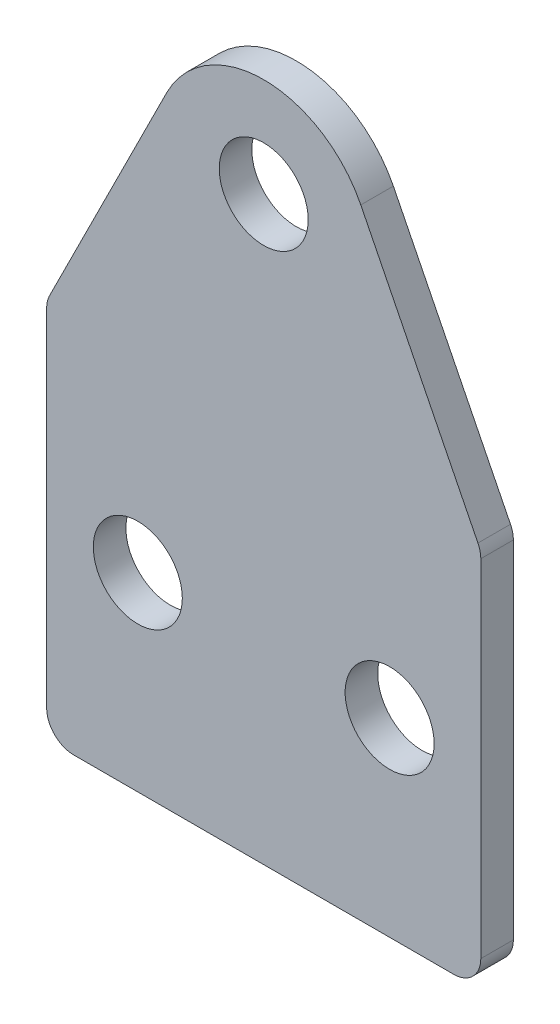
ISO-10303-21;
HEADER;
FILE_DESCRIPTION(('STEP AP214'),'2;1');
FILE_NAME('part.step','',(''),(''),'','','');
FILE_SCHEMA(('AUTOMOTIVE_DESIGN { 1 0 10303 214 1 1 1 1 }'));
ENDSEC;
DATA;
#1=APPLICATION_CONTEXT('core data for automotive mechanical design processes');
#2=APPLICATION_PROTOCOL_DEFINITION('international standard','automotive_design',2000,#1);
#3=PRODUCT_CONTEXT('',#1,'mechanical');
#4=PRODUCT('Part','Part','',(#3));
#5=PRODUCT_RELATED_PRODUCT_CATEGORY('part','',(#4));
#6=PRODUCT_DEFINITION_FORMATION('','',#4);
#7=PRODUCT_DEFINITION_CONTEXT('part definition',#1,'design');
#8=PRODUCT_DEFINITION('design','',#6,#7);
#9=PRODUCT_DEFINITION_SHAPE('','',#8);
#10=(LENGTH_UNIT() NAMED_UNIT(*) SI_UNIT(.MILLI.,.METRE.));
#11=(NAMED_UNIT(*) PLANE_ANGLE_UNIT() SI_UNIT($,.RADIAN.));
#12=(NAMED_UNIT(*) SI_UNIT($,.STERADIAN.) SOLID_ANGLE_UNIT());
#13=UNCERTAINTY_MEASURE_WITH_UNIT(LENGTH_MEASURE(1.E-05),#10,'distance_accuracy_value','');
#14=(GEOMETRIC_REPRESENTATION_CONTEXT(3) GLOBAL_UNCERTAINTY_ASSIGNED_CONTEXT((#13)) GLOBAL_UNIT_ASSIGNED_CONTEXT((#10,
#11,#12)) REPRESENTATION_CONTEXT('',''));
#15=CARTESIAN_POINT('',(0.,0.,0.));
#16=DIRECTION('',(0.,0.,1.));
#17=DIRECTION('',(1.,0.,0.));
#18=AXIS2_PLACEMENT_3D('',#15,#16,#17);
#19=CARTESIAN_POINT('',(0.,0.,3.));
#20=DIRECTION('',(0.,0.,1.));
#21=DIRECTION('',(1.,0.,0.));
#22=AXIS2_PLACEMENT_3D('',#19,#20,#21);
#23=PLANE('',#22);
#24=CARTESIAN_POINT('',(11.6,0.,3.));
#25=DIRECTION('',(0.,0.,1.));
#26=DIRECTION('',(1.,0.,0.));
#27=AXIS2_PLACEMENT_3D('',#24,#25,#26);
#28=CIRCLE('',#27,4.1);
#29=CARTESIAN_POINT('',(15.7,0.,3.));
#30=VERTEX_POINT('',#29);
#31=EDGE_CURVE('E188',#30,#30,#28,.T.);
#32=ORIENTED_EDGE('',*,*,#31,.F.);
#33=EDGE_LOOP('',(#32));
#34=FACE_BOUND('',#33,.T.);
#35=DIRECTION('',(-0.447213595499958,0.894427190999916,0.));
#36=VECTOR('',#35,1.);
#37=CARTESIAN_POINT('',(0.,57.5,3.));
#38=LINE('',#37,#36);
#39=CARTESIAN_POINT('',(19.7360679774998,18.0278640450004,3.));
#40=VERTEX_POINT('',#39);
#41=CARTESIAN_POINT('',(8.94427190999916,39.6114561800017,3.));
#42=VERTEX_POINT('',#41);
#43=EDGE_CURVE('E129',#40,#42,#38,.T.);
#44=ORIENTED_EDGE('',*,*,#43,.T.);
#45=CARTESIAN_POINT('',(0.,35.1393202250021,3.));
#46=DIRECTION('',(0.,0.,1.));
#47=DIRECTION('',(1.,0.,0.));
#48=AXIS2_PLACEMENT_3D('',#45,#46,#47);
#49=CIRCLE('',#48,10.);
#50=CARTESIAN_POINT('',(-8.94427190999916,39.6114561800017,3.));
#51=VERTEX_POINT('',#50);
#52=EDGE_CURVE('E9',#42,#51,#49,.T.);
#53=ORIENTED_EDGE('',*,*,#52,.T.);
#54=DIRECTION('',(-0.447213595499958,-0.894427190999916,0.));
#55=VECTOR('',#54,1.);
#56=CARTESIAN_POINT('',(-20.,17.5,3.));
#57=LINE('',#56,#55);
#58=CARTESIAN_POINT('',(-19.7360679774998,18.0278640450004,3.));
#59=VERTEX_POINT('',#58);
#60=EDGE_CURVE('E165',#51,#59,#57,.T.);
#61=ORIENTED_EDGE('',*,*,#60,.T.);
#62=CARTESIAN_POINT('',(-17.5,16.9098300562505,3.));
#63=DIRECTION('',(0.,0.,1.));
#64=DIRECTION('',(1.,0.,0.));
#65=AXIS2_PLACEMENT_3D('',#62,#63,#64);
#66=CIRCLE('',#65,2.5);
#67=CARTESIAN_POINT('',(-20.,16.9098300562505,3.));
#68=VERTEX_POINT('',#67);
#69=EDGE_CURVE('E143',#59,#68,#66,.T.);
#70=ORIENTED_EDGE('',*,*,#69,.T.);
#71=DIRECTION('',(0.,-1.,0.));
#72=VECTOR('',#71,1.);
#73=CARTESIAN_POINT('',(-20.,-17.5,3.));
#74=LINE('',#73,#72);
#75=CARTESIAN_POINT('',(-20.,-15.,3.));
#76=VERTEX_POINT('',#75);
#77=EDGE_CURVE('E110',#68,#76,#74,.T.);
#78=ORIENTED_EDGE('',*,*,#77,.T.);
#79=CARTESIAN_POINT('',(-17.5,-15.,3.));
#80=DIRECTION('',(0.,0.,1.));
#81=DIRECTION('',(1.,0.,0.));
#82=AXIS2_PLACEMENT_3D('',#79,#80,#81);
#83=CIRCLE('',#82,2.5);
#84=CARTESIAN_POINT('',(-17.5,-17.5,3.));
#85=VERTEX_POINT('',#84);
#86=EDGE_CURVE('E137',#76,#85,#83,.T.);
#87=ORIENTED_EDGE('',*,*,#86,.T.);
#88=DIRECTION('',(1.,0.,0.));
#89=VECTOR('',#88,1.);
#90=CARTESIAN_POINT('',(-20.,-17.5,3.));
#91=LINE('',#90,#89);
#92=CARTESIAN_POINT('',(17.5,-17.5,3.));
#93=VERTEX_POINT('',#92);
#94=EDGE_CURVE('E180',#85,#93,#91,.T.);
#95=ORIENTED_EDGE('',*,*,#94,.T.);
#96=CARTESIAN_POINT('',(17.5,-15.,3.));
#97=DIRECTION('',(0.,0.,1.));
#98=DIRECTION('',(1.,0.,0.));
#99=AXIS2_PLACEMENT_3D('',#96,#97,#98);
#100=CIRCLE('',#99,2.5);
#101=CARTESIAN_POINT('',(20.,-15.,3.));
#102=VERTEX_POINT('',#101);
#103=EDGE_CURVE('E139',#93,#102,#100,.T.);
#104=ORIENTED_EDGE('',*,*,#103,.T.);
#105=DIRECTION('',(0.,1.,0.));
#106=VECTOR('',#105,1.);
#107=CARTESIAN_POINT('',(20.,-17.5,3.));
#108=LINE('',#107,#106);
#109=CARTESIAN_POINT('',(20.,16.9098300562505,3.));
#110=VERTEX_POINT('',#109);
#111=EDGE_CURVE('E130',#102,#110,#108,.T.);
#112=ORIENTED_EDGE('',*,*,#111,.T.);
#113=CARTESIAN_POINT('',(17.5,16.9098300562505,3.));
#114=DIRECTION('',(0.,0.,1.));
#115=DIRECTION('',(1.,0.,0.));
#116=AXIS2_PLACEMENT_3D('',#113,#114,#115);
#117=CIRCLE('',#116,2.5);
#118=EDGE_CURVE('E141',#110,#40,#117,.T.);
#119=ORIENTED_EDGE('',*,*,#118,.T.);
#120=EDGE_LOOP('',(#44,#53,#61,#70,#78,#87,#95,#104,#112,#119));
#121=FACE_BOUND('',#120,.T.);
#122=CARTESIAN_POINT('',(-11.6,0.,3.));
#123=DIRECTION('',(0.,0.,1.));
#124=DIRECTION('',(1.,0.,0.));
#125=AXIS2_PLACEMENT_3D('',#122,#123,#124);
#126=CIRCLE('',#125,4.1);
#127=CARTESIAN_POINT('',(-7.5,0.,3.));
#128=VERTEX_POINT('',#127);
#129=EDGE_CURVE('E183',#128,#128,#126,.T.);
#130=ORIENTED_EDGE('',*,*,#129,.F.);
#131=EDGE_LOOP('',(#130));
#132=FACE_BOUND('',#131,.T.);
#133=CARTESIAN_POINT('',(0.,36.,3.));
#134=DIRECTION('',(0.,0.,1.));
#135=DIRECTION('',(1.,0.,0.));
#136=AXIS2_PLACEMENT_3D('',#133,#134,#135);
#137=CIRCLE('',#136,4.1);
#138=CARTESIAN_POINT('',(4.1,36.,3.));
#139=VERTEX_POINT('',#138);
#140=EDGE_CURVE('E193',#139,#139,#137,.T.);
#141=ORIENTED_EDGE('',*,*,#140,.F.);
#142=EDGE_LOOP('',(#141));
#143=FACE_BOUND('',#142,.T.);
#144=ADVANCED_FACE('F15',(#34,#121,#132,#143),#23,.T.);
#145=CARTESIAN_POINT('',(0.,0.,0.));
#146=DIRECTION('',(0.,0.,1.));
#147=DIRECTION('',(1.,0.,0.));
#148=AXIS2_PLACEMENT_3D('',#145,#146,#147);
#149=PLANE('',#148);
#150=DIRECTION('',(-0.447213595499958,-0.894427190999916,0.));
#151=VECTOR('',#150,1.);
#152=CARTESIAN_POINT('',(-20.,17.5,0.));
#153=LINE('',#152,#151);
#154=CARTESIAN_POINT('',(-8.94427190999916,39.6114561800017,0.));
#155=VERTEX_POINT('',#154);
#156=CARTESIAN_POINT('',(-19.7360679774998,18.0278640450004,0.));
#157=VERTEX_POINT('',#156);
#158=EDGE_CURVE('E118',#155,#157,#153,.T.);
#159=ORIENTED_EDGE('',*,*,#158,.F.);
#160=CARTESIAN_POINT('',(0.,35.1393202250021,0.));
#161=DIRECTION('',(0.,0.,1.));
#162=DIRECTION('',(1.,0.,0.));
#163=AXIS2_PLACEMENT_3D('',#160,#161,#162);
#164=CIRCLE('',#163,10.);
#165=CARTESIAN_POINT('',(8.94427190999916,39.6114561800017,0.));
#166=VERTEX_POINT('',#165);
#167=EDGE_CURVE('E37',#155,#166,#164,.F.);
#168=ORIENTED_EDGE('',*,*,#167,.T.);
#169=DIRECTION('',(-0.447213595499958,0.894427190999916,0.));
#170=VECTOR('',#169,1.);
#171=CARTESIAN_POINT('',(0.,57.5,0.));
#172=LINE('',#171,#170);
#173=CARTESIAN_POINT('',(19.7360679774998,18.0278640450004,0.));
#174=VERTEX_POINT('',#173);
#175=EDGE_CURVE('E123',#174,#166,#172,.T.);
#176=ORIENTED_EDGE('',*,*,#175,.F.);
#177=CARTESIAN_POINT('',(17.5,16.9098300562505,0.));
#178=DIRECTION('',(0.,0.,1.));
#179=DIRECTION('',(1.,0.,0.));
#180=AXIS2_PLACEMENT_3D('',#177,#178,#179);
#181=CIRCLE('',#180,2.5);
#182=CARTESIAN_POINT('',(20.,16.9098300562505,0.));
#183=VERTEX_POINT('',#182);
#184=EDGE_CURVE('E101',#174,#183,#181,.F.);
#185=ORIENTED_EDGE('',*,*,#184,.T.);
#186=DIRECTION('',(0.,1.,0.));
#187=VECTOR('',#186,1.);
#188=CARTESIAN_POINT('',(20.,-17.5,0.));
#189=LINE('',#188,#187);
#190=CARTESIAN_POINT('',(20.,-15.,0.));
#191=VERTEX_POINT('',#190);
#192=EDGE_CURVE('E121',#191,#183,#189,.T.);
#193=ORIENTED_EDGE('',*,*,#192,.F.);
#194=CARTESIAN_POINT('',(17.5,-15.,0.));
#195=DIRECTION('',(0.,0.,1.));
#196=DIRECTION('',(1.,0.,0.));
#197=AXIS2_PLACEMENT_3D('',#194,#195,#196);
#198=CIRCLE('',#197,2.5);
#199=CARTESIAN_POINT('',(17.5,-17.5,0.));
#200=VERTEX_POINT('',#199);
#201=EDGE_CURVE('E133',#191,#200,#198,.F.);
#202=ORIENTED_EDGE('',*,*,#201,.T.);
#203=DIRECTION('',(1.,0.,0.));
#204=VECTOR('',#203,1.);
#205=CARTESIAN_POINT('',(-20.,-17.5,0.));
#206=LINE('',#205,#204);
#207=CARTESIAN_POINT('',(-17.5,-17.5,0.));
#208=VERTEX_POINT('',#207);
#209=EDGE_CURVE('E117',#208,#200,#206,.T.);
#210=ORIENTED_EDGE('',*,*,#209,.F.);
#211=CARTESIAN_POINT('',(-17.5,-15.,0.));
#212=DIRECTION('',(0.,0.,1.));
#213=DIRECTION('',(1.,0.,0.));
#214=AXIS2_PLACEMENT_3D('',#211,#212,#213);
#215=CIRCLE('',#214,2.5);
#216=CARTESIAN_POINT('',(-20.,-15.,0.));
#217=VERTEX_POINT('',#216);
#218=EDGE_CURVE('E111',#208,#217,#215,.F.);
#219=ORIENTED_EDGE('',*,*,#218,.T.);
#220=DIRECTION('',(0.,-1.,0.));
#221=VECTOR('',#220,1.);
#222=CARTESIAN_POINT('',(-20.,-17.5,0.));
#223=LINE('',#222,#221);
#224=CARTESIAN_POINT('',(-20.,16.9098300562505,0.));
#225=VERTEX_POINT('',#224);
#226=EDGE_CURVE('E107',#225,#217,#223,.T.);
#227=ORIENTED_EDGE('',*,*,#226,.F.);
#228=CARTESIAN_POINT('',(-17.5,16.9098300562505,0.));
#229=DIRECTION('',(0.,0.,1.));
#230=DIRECTION('',(1.,0.,0.));
#231=AXIS2_PLACEMENT_3D('',#228,#229,#230);
#232=CIRCLE('',#231,2.5);
#233=EDGE_CURVE('E93',#225,#157,#232,.F.);
#234=ORIENTED_EDGE('',*,*,#233,.T.);
#235=EDGE_LOOP('',(#159,#168,#176,#185,#193,#202,#210,#219,#227,#234));
#236=FACE_BOUND('',#235,.T.);
#237=CARTESIAN_POINT('',(-11.6,0.,0.));
#238=DIRECTION('',(0.,0.,1.));
#239=DIRECTION('',(1.,0.,0.));
#240=AXIS2_PLACEMENT_3D('',#237,#238,#239);
#241=CIRCLE('',#240,4.1);
#242=CARTESIAN_POINT('',(-7.5,0.,0.));
#243=VERTEX_POINT('',#242);
#244=EDGE_CURVE('E176',#243,#243,#241,.T.);
#245=ORIENTED_EDGE('',*,*,#244,.T.);
#246=EDGE_LOOP('',(#245));
#247=FACE_BOUND('',#246,.T.);
#248=CARTESIAN_POINT('',(11.6,0.,0.));
#249=DIRECTION('',(0.,0.,1.));
#250=DIRECTION('',(1.,0.,0.));
#251=AXIS2_PLACEMENT_3D('',#248,#249,#250);
#252=CIRCLE('',#251,4.1);
#253=CARTESIAN_POINT('',(15.7,0.,0.));
#254=VERTEX_POINT('',#253);
#255=EDGE_CURVE('E190',#254,#254,#252,.T.);
#256=ORIENTED_EDGE('',*,*,#255,.T.);
#257=EDGE_LOOP('',(#256));
#258=FACE_BOUND('',#257,.T.);
#259=CARTESIAN_POINT('',(0.,36.,0.));
#260=DIRECTION('',(0.,0.,1.));
#261=DIRECTION('',(1.,0.,0.));
#262=AXIS2_PLACEMENT_3D('',#259,#260,#261);
#263=CIRCLE('',#262,4.1);
#264=CARTESIAN_POINT('',(4.1,36.,0.));
#265=VERTEX_POINT('',#264);
#266=EDGE_CURVE('E196',#265,#265,#263,.T.);
#267=ORIENTED_EDGE('',*,*,#266,.T.);
#268=EDGE_LOOP('',(#267));
#269=FACE_BOUND('',#268,.T.);
#270=ADVANCED_FACE('F114',(#236,#247,#258,#269),#149,.F.);
#271=CARTESIAN_POINT('',(0.,57.5,3.));
#272=DIRECTION('',(-0.894427190999916,-0.447213595499958,0.));
#273=DIRECTION('',(0.447213595499958,-0.894427190999916,0.));
#274=AXIS2_PLACEMENT_3D('',#271,#272,#273);
#275=PLANE('',#274);
#276=ORIENTED_EDGE('',*,*,#175,.T.);
#277=DIRECTION('',(0.,0.,-1.));
#278=VECTOR('',#277,1.);
#279=CARTESIAN_POINT('',(8.94427190999916,39.6114561800017,3.));
#280=LINE('',#279,#278);
#281=EDGE_CURVE('E23',#166,#42,#280,.F.);
#282=ORIENTED_EDGE('',*,*,#281,.T.);
#283=ORIENTED_EDGE('',*,*,#43,.F.);
#284=DIRECTION('',(0.,0.,-1.));
#285=VECTOR('',#284,1.);
#286=CARTESIAN_POINT('',(19.7360679774998,18.0278640450004,3.));
#287=LINE('',#286,#285);
#288=EDGE_CURVE('E145',#40,#174,#287,.T.);
#289=ORIENTED_EDGE('',*,*,#288,.T.);
#290=EDGE_LOOP('',(#276,#282,#283,#289));
#291=FACE_BOUND('',#290,.T.);
#292=ADVANCED_FACE('F212',(#291),#275,.F.);
#293=CARTESIAN_POINT('',(-20.,17.5,3.));
#294=DIRECTION('',(0.894427190999916,-0.447213595499958,0.));
#295=DIRECTION('',(0.447213595499958,0.894427190999916,0.));
#296=AXIS2_PLACEMENT_3D('',#293,#294,#295);
#297=PLANE('',#296);
#298=ORIENTED_EDGE('',*,*,#60,.F.);
#299=DIRECTION('',(0.,0.,-1.));
#300=VECTOR('',#299,1.);
#301=CARTESIAN_POINT('',(-8.94427190999916,39.6114561800017,3.));
#302=LINE('',#301,#300);
#303=EDGE_CURVE('E158',#51,#155,#302,.T.);
#304=ORIENTED_EDGE('',*,*,#303,.T.);
#305=ORIENTED_EDGE('',*,*,#158,.T.);
#306=DIRECTION('',(0.,0.,-1.));
#307=VECTOR('',#306,1.);
#308=CARTESIAN_POINT('',(-19.7360679774998,18.0278640450004,3.));
#309=LINE('',#308,#307);
#310=EDGE_CURVE('E99',#157,#59,#309,.F.);
#311=ORIENTED_EDGE('',*,*,#310,.T.);
#312=EDGE_LOOP('',(#298,#304,#305,#311));
#313=FACE_BOUND('',#312,.T.);
#314=ADVANCED_FACE('F164',(#313),#297,.F.);
#315=CARTESIAN_POINT('',(-20.,-17.5,3.));
#316=DIRECTION('',(1.,0.,0.));
#317=DIRECTION('',(0.,0.,-1.));
#318=AXIS2_PLACEMENT_3D('',#315,#316,#317);
#319=PLANE('',#318);
#320=ORIENTED_EDGE('',*,*,#77,.F.);
#321=DIRECTION('',(0.,0.,-1.));
#322=VECTOR('',#321,1.);
#323=CARTESIAN_POINT('',(-20.,16.9098300562505,3.));
#324=LINE('',#323,#322);
#325=EDGE_CURVE('E97',#68,#225,#324,.T.);
#326=ORIENTED_EDGE('',*,*,#325,.T.);
#327=ORIENTED_EDGE('',*,*,#226,.T.);
#328=DIRECTION('',(0.,0.,-1.));
#329=VECTOR('',#328,1.);
#330=CARTESIAN_POINT('',(-20.,-15.,3.));
#331=LINE('',#330,#329);
#332=EDGE_CURVE('E112',#217,#76,#331,.F.);
#333=ORIENTED_EDGE('',*,*,#332,.T.);
#334=EDGE_LOOP('',(#320,#326,#327,#333));
#335=FACE_BOUND('',#334,.T.);
#336=ADVANCED_FACE('F106',(#335),#319,.F.);
#337=CARTESIAN_POINT('',(-20.,-17.5,3.));
#338=DIRECTION('',(0.,1.,0.));
#339=DIRECTION('',(0.,0.,1.));
#340=AXIS2_PLACEMENT_3D('',#337,#338,#339);
#341=PLANE('',#340);
#342=ORIENTED_EDGE('',*,*,#209,.T.);
#343=DIRECTION('',(0.,0.,-1.));
#344=VECTOR('',#343,1.);
#345=CARTESIAN_POINT('',(17.5,-17.5,3.));
#346=LINE('',#345,#344);
#347=EDGE_CURVE('E156',#200,#93,#346,.F.);
#348=ORIENTED_EDGE('',*,*,#347,.T.);
#349=ORIENTED_EDGE('',*,*,#94,.F.);
#350=DIRECTION('',(0.,0.,-1.));
#351=VECTOR('',#350,1.);
#352=CARTESIAN_POINT('',(-17.5,-17.5,3.));
#353=LINE('',#352,#351);
#354=EDGE_CURVE('E153',#85,#208,#353,.T.);
#355=ORIENTED_EDGE('',*,*,#354,.T.);
#356=EDGE_LOOP('',(#342,#348,#349,#355));
#357=FACE_BOUND('',#356,.T.);
#358=ADVANCED_FACE('F222',(#357),#341,.F.);
#359=CARTESIAN_POINT('',(20.,-17.5,3.));
#360=DIRECTION('',(-1.,0.,0.));
#361=DIRECTION('',(0.,-1.,0.));
#362=AXIS2_PLACEMENT_3D('',#359,#360,#361);
#363=PLANE('',#362);
#364=ORIENTED_EDGE('',*,*,#192,.T.);
#365=DIRECTION('',(0.,0.,-1.));
#366=VECTOR('',#365,1.);
#367=CARTESIAN_POINT('',(20.,16.9098300562505,3.));
#368=LINE('',#367,#366);
#369=EDGE_CURVE('E151',#183,#110,#368,.F.);
#370=ORIENTED_EDGE('',*,*,#369,.T.);
#371=ORIENTED_EDGE('',*,*,#111,.F.);
#372=DIRECTION('',(0.,0.,-1.));
#373=VECTOR('',#372,1.);
#374=CARTESIAN_POINT('',(20.,-15.,3.));
#375=LINE('',#374,#373);
#376=EDGE_CURVE('E148',#102,#191,#375,.T.);
#377=ORIENTED_EDGE('',*,*,#376,.T.);
#378=EDGE_LOOP('',(#364,#370,#371,#377));
#379=FACE_BOUND('',#378,.T.);
#380=ADVANCED_FACE('F219',(#379),#363,.F.);
#381=CARTESIAN_POINT('',(-11.6,0.,3.));
#382=DIRECTION('',(0.,0.,-1.));
#383=DIRECTION('',(-1.,0.,0.));
#384=AXIS2_PLACEMENT_3D('',#381,#382,#383);
#385=CYLINDRICAL_SURFACE('',#384,4.1);
#386=ORIENTED_EDGE('',*,*,#129,.T.);
#387=EDGE_LOOP('',(#386));
#388=FACE_BOUND('',#387,.T.);
#389=ORIENTED_EDGE('',*,*,#244,.F.);
#390=EDGE_LOOP('',(#389));
#391=FACE_BOUND('',#390,.T.);
#392=ADVANCED_FACE('F216',(#388,#391),#385,.F.);
#393=CARTESIAN_POINT('',(11.6,0.,3.));
#394=DIRECTION('',(0.,0.,-1.));
#395=DIRECTION('',(-1.,0.,0.));
#396=AXIS2_PLACEMENT_3D('',#393,#394,#395);
#397=CYLINDRICAL_SURFACE('',#396,4.1);
#398=ORIENTED_EDGE('',*,*,#31,.T.);
#399=EDGE_LOOP('',(#398));
#400=FACE_BOUND('',#399,.T.);
#401=ORIENTED_EDGE('',*,*,#255,.F.);
#402=EDGE_LOOP('',(#401));
#403=FACE_BOUND('',#402,.T.);
#404=ADVANCED_FACE('F297',(#400,#403),#397,.F.);
#405=CARTESIAN_POINT('',(0.,36.,3.));
#406=DIRECTION('',(0.,0.,-1.));
#407=DIRECTION('',(-1.,0.,0.));
#408=AXIS2_PLACEMENT_3D('',#405,#406,#407);
#409=CYLINDRICAL_SURFACE('',#408,4.1);
#410=ORIENTED_EDGE('',*,*,#140,.T.);
#411=EDGE_LOOP('',(#410));
#412=FACE_BOUND('',#411,.T.);
#413=ORIENTED_EDGE('',*,*,#266,.F.);
#414=EDGE_LOOP('',(#413));
#415=FACE_BOUND('',#414,.T.);
#416=ADVANCED_FACE('F202',(#412,#415),#409,.F.);
#417=CARTESIAN_POINT('',(-17.5,16.9098300562505,3.));
#418=DIRECTION('',(0.,0.,-1.));
#419=DIRECTION('',(-1.,0.,0.));
#420=AXIS2_PLACEMENT_3D('',#417,#418,#419);
#421=CYLINDRICAL_SURFACE('',#420,2.5);
#422=ORIENTED_EDGE('',*,*,#69,.F.);
#423=ORIENTED_EDGE('',*,*,#310,.F.);
#424=ORIENTED_EDGE('',*,*,#233,.F.);
#425=ORIENTED_EDGE('',*,*,#325,.F.);
#426=EDGE_LOOP('',(#422,#423,#424,#425));
#427=FACE_BOUND('',#426,.T.);
#428=ADVANCED_FACE('F96',(#427),#421,.T.);
#429=CARTESIAN_POINT('',(17.5,16.9098300562505,3.));
#430=DIRECTION('',(0.,0.,-1.));
#431=DIRECTION('',(-1.,0.,0.));
#432=AXIS2_PLACEMENT_3D('',#429,#430,#431);
#433=CYLINDRICAL_SURFACE('',#432,2.5);
#434=ORIENTED_EDGE('',*,*,#118,.F.);
#435=ORIENTED_EDGE('',*,*,#369,.F.);
#436=ORIENTED_EDGE('',*,*,#184,.F.);
#437=ORIENTED_EDGE('',*,*,#288,.F.);
#438=EDGE_LOOP('',(#434,#435,#436,#437));
#439=FACE_BOUND('',#438,.T.);
#440=ADVANCED_FACE('F235',(#439),#433,.T.);
#441=CARTESIAN_POINT('',(17.5,-15.,3.));
#442=DIRECTION('',(0.,0.,-1.));
#443=DIRECTION('',(-1.,0.,0.));
#444=AXIS2_PLACEMENT_3D('',#441,#442,#443);
#445=CYLINDRICAL_SURFACE('',#444,2.5);
#446=ORIENTED_EDGE('',*,*,#103,.F.);
#447=ORIENTED_EDGE('',*,*,#347,.F.);
#448=ORIENTED_EDGE('',*,*,#201,.F.);
#449=ORIENTED_EDGE('',*,*,#376,.F.);
#450=EDGE_LOOP('',(#446,#447,#448,#449));
#451=FACE_BOUND('',#450,.T.);
#452=ADVANCED_FACE('F238',(#451),#445,.T.);
#453=CARTESIAN_POINT('',(-17.5,-15.,3.));
#454=DIRECTION('',(0.,0.,-1.));
#455=DIRECTION('',(-1.,0.,0.));
#456=AXIS2_PLACEMENT_3D('',#453,#454,#455);
#457=CYLINDRICAL_SURFACE('',#456,2.5);
#458=ORIENTED_EDGE('',*,*,#86,.F.);
#459=ORIENTED_EDGE('',*,*,#332,.F.);
#460=ORIENTED_EDGE('',*,*,#218,.F.);
#461=ORIENTED_EDGE('',*,*,#354,.F.);
#462=EDGE_LOOP('',(#458,#459,#460,#461));
#463=FACE_BOUND('',#462,.T.);
#464=ADVANCED_FACE('F241',(#463),#457,.T.);
#465=CARTESIAN_POINT('',(0.,35.1393202250021,3.));
#466=DIRECTION('',(0.,0.,-1.));
#467=DIRECTION('',(-1.,0.,0.));
#468=AXIS2_PLACEMENT_3D('',#465,#466,#467);
#469=CYLINDRICAL_SURFACE('',#468,10.);
#470=ORIENTED_EDGE('',*,*,#52,.F.);
#471=ORIENTED_EDGE('',*,*,#281,.F.);
#472=ORIENTED_EDGE('',*,*,#167,.F.);
#473=ORIENTED_EDGE('',*,*,#303,.F.);
#474=EDGE_LOOP('',(#470,#471,#472,#473));
#475=FACE_BOUND('',#474,.T.);
#476=ADVANCED_FACE('F17',(#475),#469,.T.);
#477=CLOSED_SHELL('',(#144,#270,#292,#314,#336,#358,#380,#392,#404,#416,#428,#440,#452,#464,#476));
#478=MANIFOLD_SOLID_BREP('B1',#477);
#479=ADVANCED_BREP_SHAPE_REPRESENTATION('',(#18,#478),#14);
#480=SHAPE_DEFINITION_REPRESENTATION(#9,#479);
ENDSEC;
END-ISO-10303-21;
